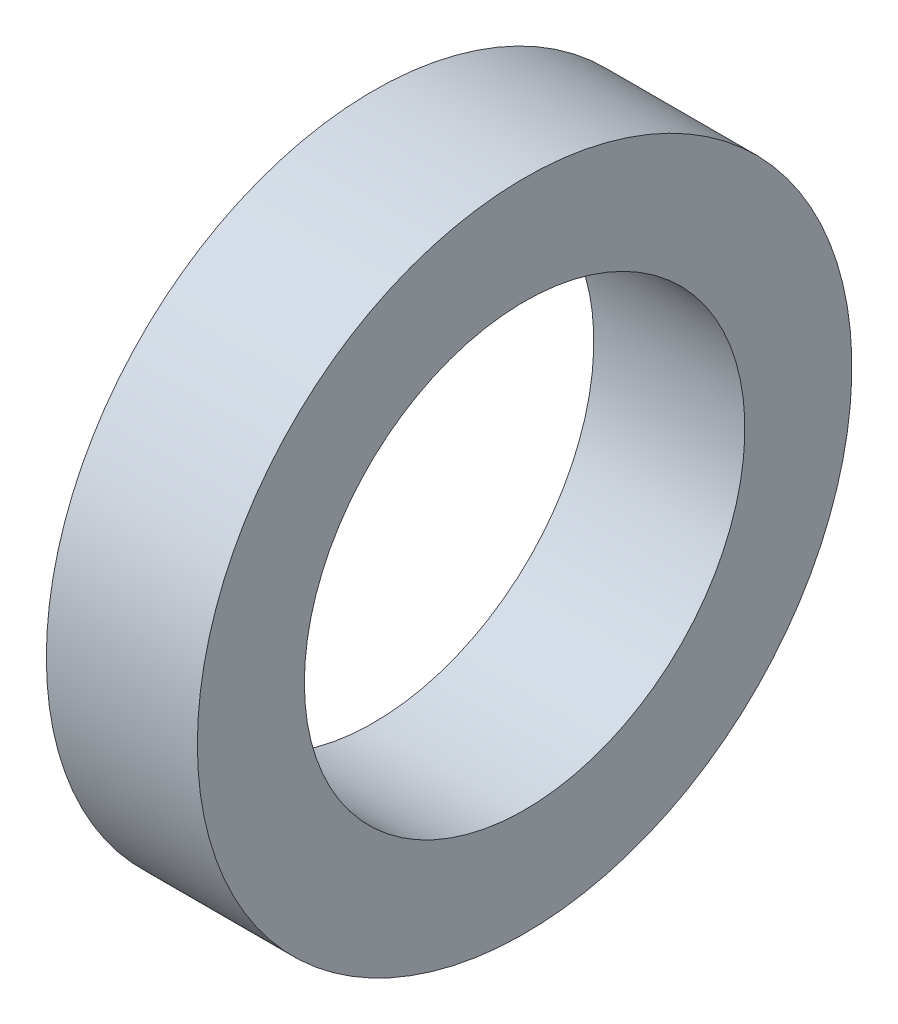
ISO-10303-21;
HEADER;
FILE_DESCRIPTION(('STEP AP214'),'2;1');
FILE_NAME('part.step','',(''),(''),'','','');
FILE_SCHEMA(('AUTOMOTIVE_DESIGN { 1 0 10303 214 1 1 1 1 }'));
ENDSEC;
DATA;
#1=APPLICATION_CONTEXT('core data for automotive mechanical design processes');
#2=APPLICATION_PROTOCOL_DEFINITION('international standard','automotive_design',2000,#1);
#3=PRODUCT_CONTEXT('',#1,'mechanical');
#4=PRODUCT('Part','Part','',(#3));
#5=PRODUCT_RELATED_PRODUCT_CATEGORY('part','',(#4));
#6=PRODUCT_DEFINITION_FORMATION('','',#4);
#7=PRODUCT_DEFINITION_CONTEXT('part definition',#1,'design');
#8=PRODUCT_DEFINITION('design','',#6,#7);
#9=PRODUCT_DEFINITION_SHAPE('','',#8);
#10=(LENGTH_UNIT() NAMED_UNIT(*) SI_UNIT(.MILLI.,.METRE.));
#11=(NAMED_UNIT(*) PLANE_ANGLE_UNIT() SI_UNIT($,.RADIAN.));
#12=(NAMED_UNIT(*) SI_UNIT($,.STERADIAN.) SOLID_ANGLE_UNIT());
#13=UNCERTAINTY_MEASURE_WITH_UNIT(LENGTH_MEASURE(1.E-05),#10,'distance_accuracy_value','');
#14=(GEOMETRIC_REPRESENTATION_CONTEXT(3) GLOBAL_UNCERTAINTY_ASSIGNED_CONTEXT((#13)) GLOBAL_UNIT_ASSIGNED_CONTEXT((#10,
#11,#12)) REPRESENTATION_CONTEXT('',''));
#15=CARTESIAN_POINT('',(0.,0.,0.));
#16=DIRECTION('',(0.,0.,1.));
#17=DIRECTION('',(1.,0.,0.));
#18=AXIS2_PLACEMENT_3D('',#15,#16,#17);
#19=CARTESIAN_POINT('',(0.,26.,0.));
#20=DIRECTION('',(1.,0.,0.));
#21=DIRECTION('',(0.,0.,-1.));
#22=AXIS2_PLACEMENT_3D('',#19,#20,#21);
#23=PLANE('',#22);
#24=CARTESIAN_POINT('',(0.,0.,0.));
#25=DIRECTION('',(-1.,0.,0.));
#26=DIRECTION('',(0.,0.,1.));
#27=AXIS2_PLACEMENT_3D('',#24,#25,#26);
#28=CIRCLE('',#27,17.5);
#29=CARTESIAN_POINT('',(0.,0.,17.5));
#30=VERTEX_POINT('',#29);
#31=EDGE_CURVE('E10',#30,#30,#28,.T.);
#32=ORIENTED_EDGE('',*,*,#31,.F.);
#33=EDGE_LOOP('',(#32));
#34=FACE_BOUND('',#33,.T.);
#35=CARTESIAN_POINT('',(0.,0.,0.));
#36=DIRECTION('',(-1.,0.,0.));
#37=DIRECTION('',(0.,0.,1.));
#38=AXIS2_PLACEMENT_3D('',#35,#36,#37);
#39=CIRCLE('',#38,26.);
#40=CARTESIAN_POINT('',(0.,0.,26.));
#41=VERTEX_POINT('',#40);
#42=EDGE_CURVE('E45',#41,#41,#39,.T.);
#43=ORIENTED_EDGE('',*,*,#42,.T.);
#44=EDGE_LOOP('',(#43));
#45=FACE_BOUND('',#44,.T.);
#46=ADVANCED_FACE('F31',(#34,#45),#23,.F.);
#47=CARTESIAN_POINT('',(0.,0.,0.));
#48=DIRECTION('',(-1.,0.,0.));
#49=DIRECTION('',(0.,0.,1.));
#50=AXIS2_PLACEMENT_3D('',#47,#48,#49);
#51=CYLINDRICAL_SURFACE('',#50,17.5);
#52=CARTESIAN_POINT('',(12.,0.,0.));
#53=DIRECTION('',(-1.,0.,0.));
#54=DIRECTION('',(0.,0.,1.));
#55=AXIS2_PLACEMENT_3D('',#52,#53,#54);
#56=CIRCLE('',#55,17.5);
#57=CARTESIAN_POINT('',(12.,0.,17.5));
#58=VERTEX_POINT('',#57);
#59=EDGE_CURVE('E37',#58,#58,#56,.T.);
#60=ORIENTED_EDGE('',*,*,#59,.F.);
#61=EDGE_LOOP('',(#60));
#62=FACE_BOUND('',#61,.T.);
#63=ORIENTED_EDGE('',*,*,#31,.T.);
#64=EDGE_LOOP('',(#63));
#65=FACE_BOUND('',#64,.T.);
#66=ADVANCED_FACE('F60',(#62,#65),#51,.F.);
#67=CARTESIAN_POINT('',(12.,17.5,0.));
#68=DIRECTION('',(-1.,0.,0.));
#69=DIRECTION('',(0.,0.,1.));
#70=AXIS2_PLACEMENT_3D('',#67,#68,#69);
#71=PLANE('',#70);
#72=CARTESIAN_POINT('',(12.,0.,0.));
#73=DIRECTION('',(-1.,0.,0.));
#74=DIRECTION('',(0.,0.,1.));
#75=AXIS2_PLACEMENT_3D('',#72,#73,#74);
#76=CIRCLE('',#75,26.);
#77=CARTESIAN_POINT('',(12.,0.,26.));
#78=VERTEX_POINT('',#77);
#79=EDGE_CURVE('E41',#78,#78,#76,.T.);
#80=ORIENTED_EDGE('',*,*,#79,.F.);
#81=EDGE_LOOP('',(#80));
#82=FACE_BOUND('',#81,.T.);
#83=ORIENTED_EDGE('',*,*,#59,.T.);
#84=EDGE_LOOP('',(#83));
#85=FACE_BOUND('',#84,.T.);
#86=ADVANCED_FACE('F55',(#82,#85),#71,.F.);
#87=CARTESIAN_POINT('',(0.,0.,0.));
#88=DIRECTION('',(-1.,0.,0.));
#89=DIRECTION('',(0.,0.,1.));
#90=AXIS2_PLACEMENT_3D('',#87,#88,#89);
#91=CYLINDRICAL_SURFACE('',#90,26.);
#92=ORIENTED_EDGE('',*,*,#42,.F.);
#93=EDGE_LOOP('',(#92));
#94=FACE_BOUND('',#93,.T.);
#95=ORIENTED_EDGE('',*,*,#79,.T.);
#96=EDGE_LOOP('',(#95));
#97=FACE_BOUND('',#96,.T.);
#98=ADVANCED_FACE('F52',(#94,#97),#91,.T.);
#99=CLOSED_SHELL('',(#46,#66,#86,#98));
#100=MANIFOLD_SOLID_BREP('B2',#99);
#101=ADVANCED_BREP_SHAPE_REPRESENTATION('',(#18,#100),#14);
#102=SHAPE_DEFINITION_REPRESENTATION(#9,#101);
ENDSEC;
END-ISO-10303-21;
